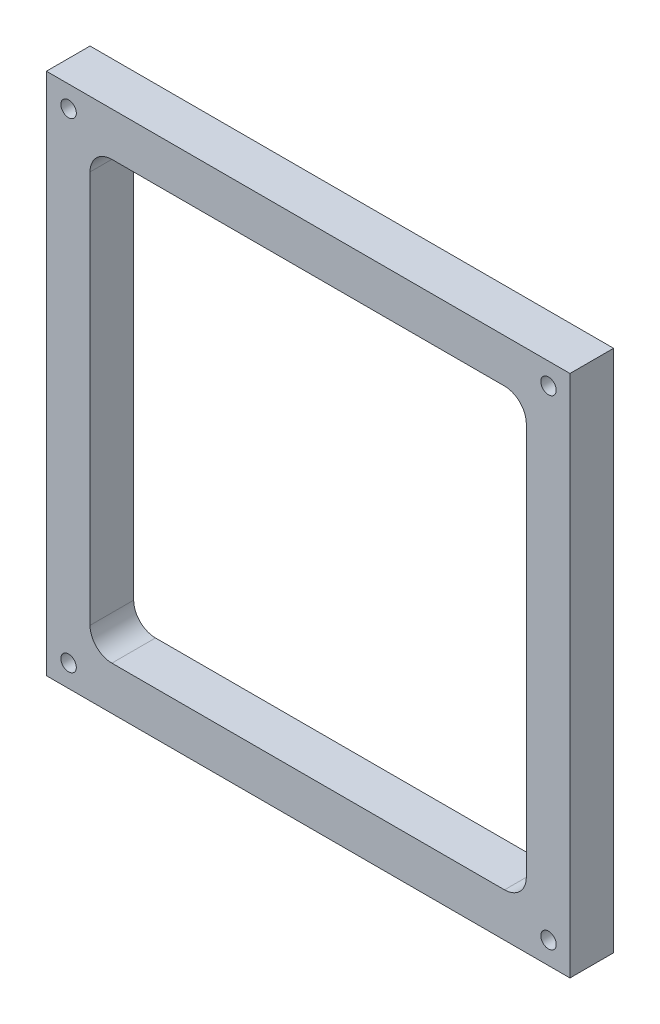
ISO-10303-21;
HEADER;
FILE_DESCRIPTION(('STEP AP214'),'2;1');
FILE_NAME('part.step','',(''),(''),'','','');
FILE_SCHEMA(('AUTOMOTIVE_DESIGN { 1 0 10303 214 1 1 1 1 }'));
ENDSEC;
DATA;
#1=APPLICATION_CONTEXT('core data for automotive mechanical design processes');
#2=APPLICATION_PROTOCOL_DEFINITION('international standard','automotive_design',2000,#1);
#3=PRODUCT_CONTEXT('',#1,'mechanical');
#4=PRODUCT('Part','Part','',(#3));
#5=PRODUCT_RELATED_PRODUCT_CATEGORY('part','',(#4));
#6=PRODUCT_DEFINITION_FORMATION('','',#4);
#7=PRODUCT_DEFINITION_CONTEXT('part definition',#1,'design');
#8=PRODUCT_DEFINITION('design','',#6,#7);
#9=PRODUCT_DEFINITION_SHAPE('','',#8);
#10=(LENGTH_UNIT() NAMED_UNIT(*) SI_UNIT(.MILLI.,.METRE.));
#11=(NAMED_UNIT(*) PLANE_ANGLE_UNIT() SI_UNIT($,.RADIAN.));
#12=(NAMED_UNIT(*) SI_UNIT($,.STERADIAN.) SOLID_ANGLE_UNIT());
#13=UNCERTAINTY_MEASURE_WITH_UNIT(LENGTH_MEASURE(1.E-05),#10,'distance_accuracy_value','');
#14=(GEOMETRIC_REPRESENTATION_CONTEXT(3) GLOBAL_UNCERTAINTY_ASSIGNED_CONTEXT((#13)) GLOBAL_UNIT_ASSIGNED_CONTEXT((#10,
#11,#12)) REPRESENTATION_CONTEXT('',''));
#15=CARTESIAN_POINT('',(0.,0.,0.));
#16=DIRECTION('',(0.,0.,1.));
#17=DIRECTION('',(1.,0.,0.));
#18=AXIS2_PLACEMENT_3D('',#15,#16,#17);
#19=CARTESIAN_POINT('',(0.,0.,12.7));
#20=DIRECTION('',(0.,0.,1.));
#21=DIRECTION('',(1.,0.,0.));
#22=AXIS2_PLACEMENT_3D('',#19,#20,#21);
#23=PLANE('',#22);
#24=CARTESIAN_POINT('',(85.0120925144108,-65.904210144278,12.7));
#25=DIRECTION('',(0.,0.,1.));
#26=DIRECTION('',(1.,0.,0.));
#27=AXIS2_PLACEMENT_3D('',#24,#25,#26);
#28=CIRCLE('',#27,2.24789999999998);
#29=CARTESIAN_POINT('',(87.2599925144108,-65.904210144278,12.7));
#30=VERTEX_POINT('',#29);
#31=EDGE_CURVE('E308',#30,#30,#28,.T.);
#32=ORIENTED_EDGE('',*,*,#31,.F.);
#33=EDGE_LOOP('',(#32));
#34=FACE_BOUND('',#33,.T.);
#35=CARTESIAN_POINT('',(85.0120925144108,73.7957898557219,12.7));
#36=DIRECTION('',(0.,0.,1.));
#37=DIRECTION('',(1.,0.,0.));
#38=AXIS2_PLACEMENT_3D('',#35,#36,#37);
#39=CIRCLE('',#38,2.24789999999998);
#40=CARTESIAN_POINT('',(87.2599925144108,73.7957898557219,12.7));
#41=VERTEX_POINT('',#40);
#42=EDGE_CURVE('E310',#41,#41,#39,.T.);
#43=ORIENTED_EDGE('',*,*,#42,.F.);
#44=EDGE_LOOP('',(#43));
#45=FACE_BOUND('',#44,.T.);
#46=CARTESIAN_POINT('',(-54.6879074855892,-65.904210144278,12.7));
#47=DIRECTION('',(0.,0.,1.));
#48=DIRECTION('',(1.,0.,0.));
#49=AXIS2_PLACEMENT_3D('',#46,#47,#48);
#50=CIRCLE('',#49,2.24789999999998);
#51=CARTESIAN_POINT('',(-52.4400074855892,-65.904210144278,12.7));
#52=VERTEX_POINT('',#51);
#53=EDGE_CURVE('E318',#52,#52,#50,.T.);
#54=ORIENTED_EDGE('',*,*,#53,.F.);
#55=EDGE_LOOP('',(#54));
#56=FACE_BOUND('',#55,.T.);
#57=CARTESIAN_POINT('',(-54.6879074855892,73.7957898557219,12.7));
#58=DIRECTION('',(0.,0.,1.));
#59=DIRECTION('',(1.,0.,0.));
#60=AXIS2_PLACEMENT_3D('',#57,#58,#59);
#61=CIRCLE('',#60,2.24789999999998);
#62=CARTESIAN_POINT('',(-52.4400074855892,73.7957898557219,12.7));
#63=VERTEX_POINT('',#62);
#64=EDGE_CURVE('E324',#63,#63,#61,.T.);
#65=ORIENTED_EDGE('',*,*,#64,.F.);
#66=EDGE_LOOP('',(#65));
#67=FACE_BOUND('',#66,.T.);
#68=DIRECTION('',(0.,-1.,0.));
#69=VECTOR('',#68,1.);
#70=CARTESIAN_POINT('',(-61.1426596043782,80.0483818357248,12.7));
#71=LINE('',#70,#69);
#72=CARTESIAN_POINT('',(-61.1426596043782,80.0483818357248,12.7));
#73=VERTEX_POINT('',#72);
#74=CARTESIAN_POINT('',(-61.1426596043782,-72.3516181642752,12.7));
#75=VERTEX_POINT('',#74);
#76=EDGE_CURVE('E189',#73,#75,#71,.T.);
#77=ORIENTED_EDGE('',*,*,#76,.T.);
#78=DIRECTION('',(1.,0.,0.));
#79=VECTOR('',#78,1.);
#80=CARTESIAN_POINT('',(-61.1426596043782,-72.3516181642752,12.7));
#81=LINE('',#80,#79);
#82=CARTESIAN_POINT('',(91.2573403956218,-72.3516181642752,12.7));
#83=VERTEX_POINT('',#82);
#84=EDGE_CURVE('E192',#75,#83,#81,.T.);
#85=ORIENTED_EDGE('',*,*,#84,.T.);
#86=DIRECTION('',(0.,1.,0.));
#87=VECTOR('',#86,1.);
#88=CARTESIAN_POINT('',(91.2573403956218,80.0483818357248,12.7));
#89=LINE('',#88,#87);
#90=CARTESIAN_POINT('',(91.2573403956218,80.0483818357248,12.7));
#91=VERTEX_POINT('',#90);
#92=EDGE_CURVE('E195',#83,#91,#89,.T.);
#93=ORIENTED_EDGE('',*,*,#92,.T.);
#94=DIRECTION('',(-1.,0.,0.));
#95=VECTOR('',#94,1.);
#96=CARTESIAN_POINT('',(-61.1426596043782,80.0483818357248,12.7));
#97=LINE('',#96,#95);
#98=EDGE_CURVE('E197',#91,#73,#97,.T.);
#99=ORIENTED_EDGE('',*,*,#98,.T.);
#100=EDGE_LOOP('',(#77,#85,#93,#99));
#101=FACE_BOUND('',#100,.T.);
#102=DIRECTION('',(0.,-1.,0.));
#103=VECTOR('',#102,1.);
#104=CARTESIAN_POINT('',(-48.4426596043782,60.9983818357248,12.7));
#105=LINE('',#104,#103);
#106=CARTESIAN_POINT('',(-48.4426596043782,60.9983818357248,12.7));
#107=VERTEX_POINT('',#106);
#108=CARTESIAN_POINT('',(-48.4426596043782,-53.3016181642752,12.7));
#109=VERTEX_POINT('',#108);
#110=EDGE_CURVE('E130',#107,#109,#105,.T.);
#111=ORIENTED_EDGE('',*,*,#110,.F.);
#112=CARTESIAN_POINT('',(-42.0926596043782,60.9983818357248,12.7));
#113=DIRECTION('',(0.,0.,1.));
#114=DIRECTION('',(-1.,0.,0.));
#115=AXIS2_PLACEMENT_3D('',#112,#113,#114);
#116=CIRCLE('',#115,6.35);
#117=CARTESIAN_POINT('',(-42.0926596043782,67.3483818357248,12.7));
#118=VERTEX_POINT('',#117);
#119=EDGE_CURVE('E122',#118,#107,#116,.T.);
#120=ORIENTED_EDGE('',*,*,#119,.F.);
#121=DIRECTION('',(-1.,0.,0.));
#122=VECTOR('',#121,1.);
#123=CARTESIAN_POINT('',(-42.0926596043782,67.3483818357248,12.7));
#124=LINE('',#123,#122);
#125=CARTESIAN_POINT('',(72.2073403956218,67.3483818357248,12.7));
#126=VERTEX_POINT('',#125);
#127=EDGE_CURVE('E156',#126,#118,#124,.T.);
#128=ORIENTED_EDGE('',*,*,#127,.F.);
#129=CARTESIAN_POINT('',(72.2073403956218,60.9983818357248,12.7));
#130=DIRECTION('',(0.,0.,1.));
#131=DIRECTION('',(-1.,0.,0.));
#132=AXIS2_PLACEMENT_3D('',#129,#130,#131);
#133=CIRCLE('',#132,6.35);
#134=CARTESIAN_POINT('',(78.5573403956218,60.9983818357248,12.7));
#135=VERTEX_POINT('',#134);
#136=EDGE_CURVE('E154',#135,#126,#133,.T.);
#137=ORIENTED_EDGE('',*,*,#136,.F.);
#138=DIRECTION('',(0.,1.,0.));
#139=VECTOR('',#138,1.);
#140=CARTESIAN_POINT('',(78.5573403956218,60.9983818357248,12.7));
#141=LINE('',#140,#139);
#142=CARTESIAN_POINT('',(78.5573403956218,-53.3016181642752,12.7));
#143=VERTEX_POINT('',#142);
#144=EDGE_CURVE('E152',#143,#135,#141,.T.);
#145=ORIENTED_EDGE('',*,*,#144,.F.);
#146=CARTESIAN_POINT('',(72.2073403956218,-53.3016181642752,12.7));
#147=DIRECTION('',(0.,0.,1.));
#148=DIRECTION('',(1.,0.,0.));
#149=AXIS2_PLACEMENT_3D('',#146,#147,#148);
#150=CIRCLE('',#149,6.34999999999999);
#151=CARTESIAN_POINT('',(72.2073403956218,-59.6516181642752,12.7));
#152=VERTEX_POINT('',#151);
#153=EDGE_CURVE('E150',#152,#143,#150,.T.);
#154=ORIENTED_EDGE('',*,*,#153,.F.);
#155=DIRECTION('',(1.,0.,0.));
#156=VECTOR('',#155,1.);
#157=CARTESIAN_POINT('',(-42.0926596043782,-59.6516181642752,12.7));
#158=LINE('',#157,#156);
#159=CARTESIAN_POINT('',(-42.0926596043782,-59.6516181642752,12.7));
#160=VERTEX_POINT('',#159);
#161=EDGE_CURVE('E145',#160,#152,#158,.T.);
#162=ORIENTED_EDGE('',*,*,#161,.F.);
#163=CARTESIAN_POINT('',(-42.0926596043782,-53.3016181642752,12.7));
#164=DIRECTION('',(0.,0.,1.));
#165=DIRECTION('',(-1.,0.,0.));
#166=AXIS2_PLACEMENT_3D('',#163,#164,#165);
#167=CIRCLE('',#166,6.35);
#168=EDGE_CURVE('E143',#109,#160,#167,.T.);
#169=ORIENTED_EDGE('',*,*,#168,.F.);
#170=EDGE_LOOP('',(#111,#120,#128,#137,#145,#154,#162,#169));
#171=FACE_BOUND('',#170,.T.);
#172=ADVANCED_FACE('F33',(#34,#45,#56,#67,#101,#171),#23,.T.);
#173=CARTESIAN_POINT('',(0.,0.,0.));
#174=DIRECTION('',(0.,0.,1.));
#175=DIRECTION('',(1.,0.,0.));
#176=AXIS2_PLACEMENT_3D('',#173,#174,#175);
#177=PLANE('',#176);
#178=CARTESIAN_POINT('',(85.0120925144108,-65.904210144278,0.));
#179=DIRECTION('',(0.,0.,1.));
#180=DIRECTION('',(1.,0.,0.));
#181=AXIS2_PLACEMENT_3D('',#178,#179,#180);
#182=CIRCLE('',#181,2.24789999999998);
#183=CARTESIAN_POINT('',(87.2599925144108,-65.904210144278,0.));
#184=VERTEX_POINT('',#183);
#185=EDGE_CURVE('E306',#184,#184,#182,.T.);
#186=ORIENTED_EDGE('',*,*,#185,.T.);
#187=EDGE_LOOP('',(#186));
#188=FACE_BOUND('',#187,.T.);
#189=CARTESIAN_POINT('',(85.0120925144108,73.7957898557219,0.));
#190=DIRECTION('',(0.,0.,1.));
#191=DIRECTION('',(1.,0.,0.));
#192=AXIS2_PLACEMENT_3D('',#189,#190,#191);
#193=CIRCLE('',#192,2.24789999999998);
#194=CARTESIAN_POINT('',(87.2599925144108,73.7957898557219,0.));
#195=VERTEX_POINT('',#194);
#196=EDGE_CURVE('E315',#195,#195,#193,.T.);
#197=ORIENTED_EDGE('',*,*,#196,.T.);
#198=EDGE_LOOP('',(#197));
#199=FACE_BOUND('',#198,.T.);
#200=CARTESIAN_POINT('',(-54.6879074855892,-65.904210144278,0.));
#201=DIRECTION('',(0.,0.,1.));
#202=DIRECTION('',(1.,0.,0.));
#203=AXIS2_PLACEMENT_3D('',#200,#201,#202);
#204=CIRCLE('',#203,2.24789999999998);
#205=CARTESIAN_POINT('',(-52.4400074855892,-65.904210144278,0.));
#206=VERTEX_POINT('',#205);
#207=EDGE_CURVE('E321',#206,#206,#204,.T.);
#208=ORIENTED_EDGE('',*,*,#207,.T.);
#209=EDGE_LOOP('',(#208));
#210=FACE_BOUND('',#209,.T.);
#211=CARTESIAN_POINT('',(-54.6879074855892,73.7957898557219,0.));
#212=DIRECTION('',(0.,0.,1.));
#213=DIRECTION('',(1.,0.,0.));
#214=AXIS2_PLACEMENT_3D('',#211,#212,#213);
#215=CIRCLE('',#214,2.24789999999998);
#216=CARTESIAN_POINT('',(-52.4400074855892,73.7957898557219,0.));
#217=VERTEX_POINT('',#216);
#218=EDGE_CURVE('E159',#217,#217,#215,.T.);
#219=ORIENTED_EDGE('',*,*,#218,.T.);
#220=EDGE_LOOP('',(#219));
#221=FACE_BOUND('',#220,.T.);
#222=DIRECTION('',(0.,-1.,0.));
#223=VECTOR('',#222,1.);
#224=CARTESIAN_POINT('',(-61.1426596043782,80.0483818357248,0.));
#225=LINE('',#224,#223);
#226=CARTESIAN_POINT('',(-61.1426596043782,80.0483818357248,0.));
#227=VERTEX_POINT('',#226);
#228=CARTESIAN_POINT('',(-61.1426596043782,-72.3516181642752,0.));
#229=VERTEX_POINT('',#228);
#230=EDGE_CURVE('E138',#227,#229,#225,.T.);
#231=ORIENTED_EDGE('',*,*,#230,.F.);
#232=DIRECTION('',(-1.,0.,0.));
#233=VECTOR('',#232,1.);
#234=CARTESIAN_POINT('',(-61.1426596043782,80.0483818357248,0.));
#235=LINE('',#234,#233);
#236=CARTESIAN_POINT('',(91.2573403956218,80.0483818357248,0.));
#237=VERTEX_POINT('',#236);
#238=EDGE_CURVE('E193',#237,#227,#235,.T.);
#239=ORIENTED_EDGE('',*,*,#238,.F.);
#240=DIRECTION('',(0.,1.,0.));
#241=VECTOR('',#240,1.);
#242=CARTESIAN_POINT('',(91.2573403956218,80.0483818357248,0.));
#243=LINE('',#242,#241);
#244=CARTESIAN_POINT('',(91.2573403956218,-72.3516181642752,0.));
#245=VERTEX_POINT('',#244);
#246=EDGE_CURVE('E204',#245,#237,#243,.T.);
#247=ORIENTED_EDGE('',*,*,#246,.F.);
#248=DIRECTION('',(1.,0.,0.));
#249=VECTOR('',#248,1.);
#250=CARTESIAN_POINT('',(-61.1426596043782,-72.3516181642752,0.));
#251=LINE('',#250,#249);
#252=EDGE_CURVE('E202',#229,#245,#251,.T.);
#253=ORIENTED_EDGE('',*,*,#252,.F.);
#254=EDGE_LOOP('',(#231,#239,#247,#253));
#255=FACE_BOUND('',#254,.T.);
#256=CARTESIAN_POINT('',(-42.0926596043782,60.9983818357248,0.));
#257=DIRECTION('',(0.,0.,1.));
#258=DIRECTION('',(-1.,0.,0.));
#259=AXIS2_PLACEMENT_3D('',#256,#257,#258);
#260=CIRCLE('',#259,6.35);
#261=CARTESIAN_POINT('',(-42.0926596043782,67.3483818357248,0.));
#262=VERTEX_POINT('',#261);
#263=CARTESIAN_POINT('',(-48.4426596043782,60.9983818357248,0.));
#264=VERTEX_POINT('',#263);
#265=EDGE_CURVE('E56',#262,#264,#260,.T.);
#266=ORIENTED_EDGE('',*,*,#265,.T.);
#267=DIRECTION('',(0.,-1.,0.));
#268=VECTOR('',#267,1.);
#269=CARTESIAN_POINT('',(-48.4426596043782,60.9983818357248,0.));
#270=LINE('',#269,#268);
#271=CARTESIAN_POINT('',(-48.4426596043782,-53.3016181642752,0.));
#272=VERTEX_POINT('',#271);
#273=EDGE_CURVE('E137',#264,#272,#270,.T.);
#274=ORIENTED_EDGE('',*,*,#273,.T.);
#275=CARTESIAN_POINT('',(-42.0926596043782,-53.3016181642752,0.));
#276=DIRECTION('',(0.,0.,1.));
#277=DIRECTION('',(-1.,0.,0.));
#278=AXIS2_PLACEMENT_3D('',#275,#276,#277);
#279=CIRCLE('',#278,6.35);
#280=CARTESIAN_POINT('',(-42.0926596043782,-59.6516181642752,0.));
#281=VERTEX_POINT('',#280);
#282=EDGE_CURVE('E161',#272,#281,#279,.T.);
#283=ORIENTED_EDGE('',*,*,#282,.T.);
#284=DIRECTION('',(1.,0.,0.));
#285=VECTOR('',#284,1.);
#286=CARTESIAN_POINT('',(-42.0926596043782,-59.6516181642752,0.));
#287=LINE('',#286,#285);
#288=CARTESIAN_POINT('',(72.2073403956218,-59.6516181642752,0.));
#289=VERTEX_POINT('',#288);
#290=EDGE_CURVE('E164',#281,#289,#287,.T.);
#291=ORIENTED_EDGE('',*,*,#290,.T.);
#292=CARTESIAN_POINT('',(72.2073403956218,-53.3016181642752,0.));
#293=DIRECTION('',(0.,0.,1.));
#294=DIRECTION('',(1.,0.,0.));
#295=AXIS2_PLACEMENT_3D('',#292,#293,#294);
#296=CIRCLE('',#295,6.34999999999999);
#297=CARTESIAN_POINT('',(78.5573403956218,-53.3016181642752,0.));
#298=VERTEX_POINT('',#297);
#299=EDGE_CURVE('E167',#289,#298,#296,.T.);
#300=ORIENTED_EDGE('',*,*,#299,.T.);
#301=DIRECTION('',(0.,1.,0.));
#302=VECTOR('',#301,1.);
#303=CARTESIAN_POINT('',(78.5573403956218,60.9983818357248,0.));
#304=LINE('',#303,#302);
#305=CARTESIAN_POINT('',(78.5573403956218,60.9983818357248,0.));
#306=VERTEX_POINT('',#305);
#307=EDGE_CURVE('E170',#298,#306,#304,.T.);
#308=ORIENTED_EDGE('',*,*,#307,.T.);
#309=CARTESIAN_POINT('',(72.2073403956218,60.9983818357248,0.));
#310=DIRECTION('',(0.,0.,1.));
#311=DIRECTION('',(-1.,0.,0.));
#312=AXIS2_PLACEMENT_3D('',#309,#310,#311);
#313=CIRCLE('',#312,6.35);
#314=CARTESIAN_POINT('',(72.2073403956218,67.3483818357248,0.));
#315=VERTEX_POINT('',#314);
#316=EDGE_CURVE('E173',#306,#315,#313,.T.);
#317=ORIENTED_EDGE('',*,*,#316,.T.);
#318=DIRECTION('',(-1.,0.,0.));
#319=VECTOR('',#318,1.);
#320=CARTESIAN_POINT('',(-42.0926596043782,67.3483818357248,0.));
#321=LINE('',#320,#319);
#322=EDGE_CURVE('E131',#315,#262,#321,.T.);
#323=ORIENTED_EDGE('',*,*,#322,.T.);
#324=EDGE_LOOP('',(#266,#274,#283,#291,#300,#308,#317,#323));
#325=FACE_BOUND('',#324,.T.);
#326=ADVANCED_FACE('F222',(#188,#199,#210,#221,#255,#325),#177,.F.);
#327=CARTESIAN_POINT('',(-61.1426596043782,80.0483818357248,12.7));
#328=DIRECTION('',(1.,0.,0.));
#329=DIRECTION('',(0.,0.,-1.));
#330=AXIS2_PLACEMENT_3D('',#327,#328,#329);
#331=PLANE('',#330);
#332=ORIENTED_EDGE('',*,*,#230,.T.);
#333=DIRECTION('',(0.,0.,-1.));
#334=VECTOR('',#333,1.);
#335=CARTESIAN_POINT('',(-61.1426596043782,-72.3516181642752,12.7));
#336=LINE('',#335,#334);
#337=EDGE_CURVE('E11',#75,#229,#336,.T.);
#338=ORIENTED_EDGE('',*,*,#337,.F.);
#339=ORIENTED_EDGE('',*,*,#76,.F.);
#340=DIRECTION('',(0.,0.,-1.));
#341=VECTOR('',#340,1.);
#342=CARTESIAN_POINT('',(-61.1426596043782,80.0483818357248,12.7));
#343=LINE('',#342,#341);
#344=EDGE_CURVE('E199',#73,#227,#343,.T.);
#345=ORIENTED_EDGE('',*,*,#344,.T.);
#346=EDGE_LOOP('',(#332,#338,#339,#345));
#347=FACE_BOUND('',#346,.T.);
#348=ADVANCED_FACE('F35',(#347),#331,.F.);
#349=CARTESIAN_POINT('',(-61.1426596043782,-72.3516181642752,12.7));
#350=DIRECTION('',(0.,1.,0.));
#351=DIRECTION('',(0.,0.,1.));
#352=AXIS2_PLACEMENT_3D('',#349,#350,#351);
#353=PLANE('',#352);
#354=ORIENTED_EDGE('',*,*,#252,.T.);
#355=DIRECTION('',(0.,0.,-1.));
#356=VECTOR('',#355,1.);
#357=CARTESIAN_POINT('',(91.2573403956218,-72.3516181642752,12.7));
#358=LINE('',#357,#356);
#359=EDGE_CURVE('E41',#83,#245,#358,.T.);
#360=ORIENTED_EDGE('',*,*,#359,.F.);
#361=ORIENTED_EDGE('',*,*,#84,.F.);
#362=ORIENTED_EDGE('',*,*,#337,.T.);
#363=EDGE_LOOP('',(#354,#360,#361,#362));
#364=FACE_BOUND('',#363,.T.);
#365=ADVANCED_FACE('F232',(#364),#353,.F.);
#366=CARTESIAN_POINT('',(91.2573403956218,80.0483818357248,12.7));
#367=DIRECTION('',(-1.,0.,0.));
#368=DIRECTION('',(0.,0.,1.));
#369=AXIS2_PLACEMENT_3D('',#366,#367,#368);
#370=PLANE('',#369);
#371=ORIENTED_EDGE('',*,*,#246,.T.);
#372=DIRECTION('',(0.,0.,-1.));
#373=VECTOR('',#372,1.);
#374=CARTESIAN_POINT('',(91.2573403956218,80.0483818357248,12.7));
#375=LINE('',#374,#373);
#376=EDGE_CURVE('E209',#91,#237,#375,.T.);
#377=ORIENTED_EDGE('',*,*,#376,.F.);
#378=ORIENTED_EDGE('',*,*,#92,.F.);
#379=ORIENTED_EDGE('',*,*,#359,.T.);
#380=EDGE_LOOP('',(#371,#377,#378,#379));
#381=FACE_BOUND('',#380,.T.);
#382=ADVANCED_FACE('F216',(#381),#370,.F.);
#383=CARTESIAN_POINT('',(-61.1426596043782,80.0483818357248,12.7));
#384=DIRECTION('',(0.,-1.,0.));
#385=DIRECTION('',(0.,0.,-1.));
#386=AXIS2_PLACEMENT_3D('',#383,#384,#385);
#387=PLANE('',#386);
#388=ORIENTED_EDGE('',*,*,#238,.T.);
#389=ORIENTED_EDGE('',*,*,#344,.F.);
#390=ORIENTED_EDGE('',*,*,#98,.F.);
#391=ORIENTED_EDGE('',*,*,#376,.T.);
#392=EDGE_LOOP('',(#388,#389,#390,#391));
#393=FACE_BOUND('',#392,.T.);
#394=ADVANCED_FACE('F226',(#393),#387,.F.);
#395=CARTESIAN_POINT('',(-42.0926596043782,60.9983818357248,12.7));
#396=DIRECTION('',(0.,0.,-1.));
#397=DIRECTION('',(-1.,0.,0.));
#398=AXIS2_PLACEMENT_3D('',#395,#396,#397);
#399=CYLINDRICAL_SURFACE('',#398,6.35);
#400=ORIENTED_EDGE('',*,*,#265,.F.);
#401=DIRECTION('',(0.,0.,-1.));
#402=VECTOR('',#401,1.);
#403=CARTESIAN_POINT('',(-42.0926596043782,67.3483818357248,12.7));
#404=LINE('',#403,#402);
#405=EDGE_CURVE('E126',#118,#262,#404,.T.);
#406=ORIENTED_EDGE('',*,*,#405,.F.);
#407=ORIENTED_EDGE('',*,*,#119,.T.);
#408=DIRECTION('',(0.,0.,-1.));
#409=VECTOR('',#408,1.);
#410=CARTESIAN_POINT('',(-48.4426596043782,60.9983818357248,12.7));
#411=LINE('',#410,#409);
#412=EDGE_CURVE('E125',#107,#264,#411,.T.);
#413=ORIENTED_EDGE('',*,*,#412,.T.);
#414=EDGE_LOOP('',(#400,#406,#407,#413));
#415=FACE_BOUND('',#414,.T.);
#416=ADVANCED_FACE('F124',(#415),#399,.F.);
#417=CARTESIAN_POINT('',(-48.4426596043782,60.9983818357248,12.7));
#418=DIRECTION('',(1.,0.,0.));
#419=DIRECTION('',(0.,0.,-1.));
#420=AXIS2_PLACEMENT_3D('',#417,#418,#419);
#421=PLANE('',#420);
#422=ORIENTED_EDGE('',*,*,#273,.F.);
#423=ORIENTED_EDGE('',*,*,#412,.F.);
#424=ORIENTED_EDGE('',*,*,#110,.T.);
#425=DIRECTION('',(0.,0.,-1.));
#426=VECTOR('',#425,1.);
#427=CARTESIAN_POINT('',(-48.4426596043782,-53.3016181642752,12.7));
#428=LINE('',#427,#426);
#429=EDGE_CURVE('E139',#109,#272,#428,.T.);
#430=ORIENTED_EDGE('',*,*,#429,.T.);
#431=EDGE_LOOP('',(#422,#423,#424,#430));
#432=FACE_BOUND('',#431,.T.);
#433=ADVANCED_FACE('F134',(#432),#421,.T.);
#434=CARTESIAN_POINT('',(-42.0926596043782,-53.3016181642752,12.7));
#435=DIRECTION('',(0.,0.,-1.));
#436=DIRECTION('',(-1.,0.,0.));
#437=AXIS2_PLACEMENT_3D('',#434,#435,#436);
#438=CYLINDRICAL_SURFACE('',#437,6.35);
#439=ORIENTED_EDGE('',*,*,#282,.F.);
#440=ORIENTED_EDGE('',*,*,#429,.F.);
#441=ORIENTED_EDGE('',*,*,#168,.T.);
#442=DIRECTION('',(0.,0.,-1.));
#443=VECTOR('',#442,1.);
#444=CARTESIAN_POINT('',(-42.0926596043782,-59.6516181642752,12.7));
#445=LINE('',#444,#443);
#446=EDGE_CURVE('E186',#160,#281,#445,.T.);
#447=ORIENTED_EDGE('',*,*,#446,.T.);
#448=EDGE_LOOP('',(#439,#440,#441,#447));
#449=FACE_BOUND('',#448,.T.);
#450=ADVANCED_FACE('F260',(#449),#438,.F.);
#451=CARTESIAN_POINT('',(-42.0926596043782,-59.6516181642752,12.7));
#452=DIRECTION('',(0.,1.,0.));
#453=DIRECTION('',(-1.,0.,0.));
#454=AXIS2_PLACEMENT_3D('',#451,#452,#453);
#455=PLANE('',#454);
#456=ORIENTED_EDGE('',*,*,#290,.F.);
#457=ORIENTED_EDGE('',*,*,#446,.F.);
#458=ORIENTED_EDGE('',*,*,#161,.T.);
#459=DIRECTION('',(0.,0.,-1.));
#460=VECTOR('',#459,1.);
#461=CARTESIAN_POINT('',(72.2073403956218,-59.6516181642752,12.7));
#462=LINE('',#461,#460);
#463=EDGE_CURVE('E184',#152,#289,#462,.T.);
#464=ORIENTED_EDGE('',*,*,#463,.T.);
#465=EDGE_LOOP('',(#456,#457,#458,#464));
#466=FACE_BOUND('',#465,.T.);
#467=ADVANCED_FACE('F264',(#466),#455,.T.);
#468=CARTESIAN_POINT('',(72.2073403956218,-53.3016181642752,12.7));
#469=DIRECTION('',(0.,0.,-1.));
#470=DIRECTION('',(-1.,0.,0.));
#471=AXIS2_PLACEMENT_3D('',#468,#469,#470);
#472=CYLINDRICAL_SURFACE('',#471,6.34999999999999);
#473=ORIENTED_EDGE('',*,*,#299,.F.);
#474=ORIENTED_EDGE('',*,*,#463,.F.);
#475=ORIENTED_EDGE('',*,*,#153,.T.);
#476=DIRECTION('',(0.,0.,-1.));
#477=VECTOR('',#476,1.);
#478=CARTESIAN_POINT('',(78.5573403956218,-53.3016181642752,12.7));
#479=LINE('',#478,#477);
#480=EDGE_CURVE('E182',#143,#298,#479,.T.);
#481=ORIENTED_EDGE('',*,*,#480,.T.);
#482=EDGE_LOOP('',(#473,#474,#475,#481));
#483=FACE_BOUND('',#482,.T.);
#484=ADVANCED_FACE('F270',(#483),#472,.F.);
#485=CARTESIAN_POINT('',(78.5573403956218,60.9983818357248,12.7));
#486=DIRECTION('',(-1.,0.,0.));
#487=DIRECTION('',(0.,0.,1.));
#488=AXIS2_PLACEMENT_3D('',#485,#486,#487);
#489=PLANE('',#488);
#490=ORIENTED_EDGE('',*,*,#307,.F.);
#491=ORIENTED_EDGE('',*,*,#480,.F.);
#492=ORIENTED_EDGE('',*,*,#144,.T.);
#493=DIRECTION('',(0.,0.,-1.));
#494=VECTOR('',#493,1.);
#495=CARTESIAN_POINT('',(78.5573403956218,60.9983818357248,12.7));
#496=LINE('',#495,#494);
#497=EDGE_CURVE('E180',#135,#306,#496,.T.);
#498=ORIENTED_EDGE('',*,*,#497,.T.);
#499=EDGE_LOOP('',(#490,#491,#492,#498));
#500=FACE_BOUND('',#499,.T.);
#501=ADVANCED_FACE('F274',(#500),#489,.T.);
#502=CARTESIAN_POINT('',(72.2073403956218,60.9983818357248,12.7));
#503=DIRECTION('',(0.,0.,-1.));
#504=DIRECTION('',(-1.,0.,0.));
#505=AXIS2_PLACEMENT_3D('',#502,#503,#504);
#506=CYLINDRICAL_SURFACE('',#505,6.35);
#507=ORIENTED_EDGE('',*,*,#316,.F.);
#508=ORIENTED_EDGE('',*,*,#497,.F.);
#509=ORIENTED_EDGE('',*,*,#136,.T.);
#510=DIRECTION('',(0.,0.,-1.));
#511=VECTOR('',#510,1.);
#512=CARTESIAN_POINT('',(72.2073403956218,67.3483818357248,12.7));
#513=LINE('',#512,#511);
#514=EDGE_CURVE('E48',#126,#315,#513,.T.);
#515=ORIENTED_EDGE('',*,*,#514,.T.);
#516=EDGE_LOOP('',(#507,#508,#509,#515));
#517=FACE_BOUND('',#516,.T.);
#518=ADVANCED_FACE('F278',(#517),#506,.F.);
#519=CARTESIAN_POINT('',(-42.0926596043782,67.3483818357248,12.7));
#520=DIRECTION('',(0.,-1.,0.));
#521=DIRECTION('',(0.,0.,-1.));
#522=AXIS2_PLACEMENT_3D('',#519,#520,#521);
#523=PLANE('',#522);
#524=ORIENTED_EDGE('',*,*,#322,.F.);
#525=ORIENTED_EDGE('',*,*,#514,.F.);
#526=ORIENTED_EDGE('',*,*,#127,.T.);
#527=ORIENTED_EDGE('',*,*,#405,.T.);
#528=EDGE_LOOP('',(#524,#525,#526,#527));
#529=FACE_BOUND('',#528,.T.);
#530=ADVANCED_FACE('F282',(#529),#523,.T.);
#531=CARTESIAN_POINT('',(-54.6879074855892,73.7957898557219,12.7));
#532=DIRECTION('',(0.,0.,1.));
#533=DIRECTION('',(1.,0.,0.));
#534=AXIS2_PLACEMENT_3D('',#531,#532,#533);
#535=CYLINDRICAL_SURFACE('',#534,2.24789999999998);
#536=ORIENTED_EDGE('',*,*,#218,.F.);
#537=EDGE_LOOP('',(#536));
#538=FACE_BOUND('',#537,.T.);
#539=ORIENTED_EDGE('',*,*,#64,.T.);
#540=EDGE_LOOP('',(#539));
#541=FACE_BOUND('',#540,.T.);
#542=ADVANCED_FACE('F286',(#538,#541),#535,.F.);
#543=CARTESIAN_POINT('',(-54.6879074855892,-65.904210144278,12.7));
#544=DIRECTION('',(0.,0.,1.));
#545=DIRECTION('',(1.,0.,0.));
#546=AXIS2_PLACEMENT_3D('',#543,#544,#545);
#547=CYLINDRICAL_SURFACE('',#546,2.24789999999998);
#548=ORIENTED_EDGE('',*,*,#207,.F.);
#549=EDGE_LOOP('',(#548));
#550=FACE_BOUND('',#549,.T.);
#551=ORIENTED_EDGE('',*,*,#53,.T.);
#552=EDGE_LOOP('',(#551));
#553=FACE_BOUND('',#552,.T.);
#554=ADVANCED_FACE('F289',(#550,#553),#547,.F.);
#555=CARTESIAN_POINT('',(85.0120925144108,73.7957898557219,12.7));
#556=DIRECTION('',(0.,0.,1.));
#557=DIRECTION('',(1.,0.,0.));
#558=AXIS2_PLACEMENT_3D('',#555,#556,#557);
#559=CYLINDRICAL_SURFACE('',#558,2.24789999999998);
#560=ORIENTED_EDGE('',*,*,#196,.F.);
#561=EDGE_LOOP('',(#560));
#562=FACE_BOUND('',#561,.T.);
#563=ORIENTED_EDGE('',*,*,#42,.T.);
#564=EDGE_LOOP('',(#563));
#565=FACE_BOUND('',#564,.T.);
#566=ADVANCED_FACE('F293',(#562,#565),#559,.F.);
#567=CARTESIAN_POINT('',(85.0120925144108,-65.904210144278,12.7));
#568=DIRECTION('',(0.,0.,1.));
#569=DIRECTION('',(1.,0.,0.));
#570=AXIS2_PLACEMENT_3D('',#567,#568,#569);
#571=CYLINDRICAL_SURFACE('',#570,2.24789999999998);
#572=ORIENTED_EDGE('',*,*,#185,.F.);
#573=EDGE_LOOP('',(#572));
#574=FACE_BOUND('',#573,.T.);
#575=ORIENTED_EDGE('',*,*,#31,.T.);
#576=EDGE_LOOP('',(#575));
#577=FACE_BOUND('',#576,.T.);
#578=ADVANCED_FACE('F297',(#574,#577),#571,.F.);
#579=CLOSED_SHELL('',(#172,#326,#348,#365,#382,#394,#416,#433,#450,#467,#484,#501,#518,#530,
#542,#554,#566,#578));
#580=MANIFOLD_SOLID_BREP('B2',#579);
#581=ADVANCED_BREP_SHAPE_REPRESENTATION('',(#18,#580),#14);
#582=SHAPE_DEFINITION_REPRESENTATION(#9,#581);
ENDSEC;
END-ISO-10303-21;
